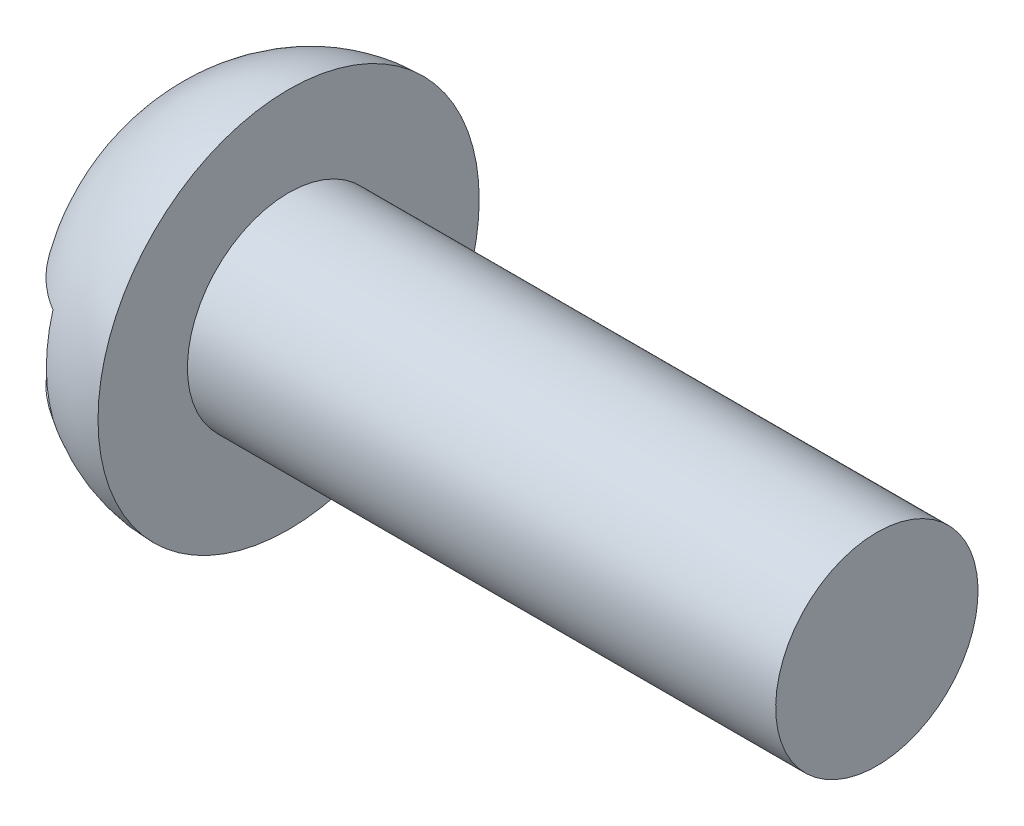
ISO-10303-21;
HEADER;
FILE_DESCRIPTION(('STEP AP214'),'2;1');
FILE_NAME('part.step','',(''),(''),'','','');
FILE_SCHEMA(('AUTOMOTIVE_DESIGN { 1 0 10303 214 1 1 1 1 }'));
ENDSEC;
DATA;
#1=APPLICATION_CONTEXT('core data for automotive mechanical design processes');
#2=APPLICATION_PROTOCOL_DEFINITION('international standard','automotive_design',2000,#1);
#3=PRODUCT_CONTEXT('',#1,'mechanical');
#4=PRODUCT('Part','Part','',(#3));
#5=PRODUCT_RELATED_PRODUCT_CATEGORY('part','',(#4));
#6=PRODUCT_DEFINITION_FORMATION('','',#4);
#7=PRODUCT_DEFINITION_CONTEXT('part definition',#1,'design');
#8=PRODUCT_DEFINITION('design','',#6,#7);
#9=PRODUCT_DEFINITION_SHAPE('','',#8);
#10=(LENGTH_UNIT() NAMED_UNIT(*) SI_UNIT(.MILLI.,.METRE.));
#11=(NAMED_UNIT(*) PLANE_ANGLE_UNIT() SI_UNIT($,.RADIAN.));
#12=(NAMED_UNIT(*) SI_UNIT($,.STERADIAN.) SOLID_ANGLE_UNIT());
#13=UNCERTAINTY_MEASURE_WITH_UNIT(LENGTH_MEASURE(1.E-05),#10,'distance_accuracy_value','');
#14=(GEOMETRIC_REPRESENTATION_CONTEXT(3) GLOBAL_UNCERTAINTY_ASSIGNED_CONTEXT((#13)) GLOBAL_UNIT_ASSIGNED_CONTEXT((#10,
#11,#12)) REPRESENTATION_CONTEXT('',''));
#15=CARTESIAN_POINT('',(0.,0.,0.));
#16=DIRECTION('',(0.,0.,1.));
#17=DIRECTION('',(1.,0.,0.));
#18=AXIS2_PLACEMENT_3D('',#15,#16,#17);
#19=CARTESIAN_POINT('',(0.,0.,0.));
#20=DIRECTION('',(0.,0.,1.));
#21=DIRECTION('',(0.,-1.,0.));
#22=AXIS2_PLACEMENT_3D('',#19,#20,#21);
#23=ELLIPSE('',#22,2.0574,1.7526);
#24=TRIMMED_CURVE('',#23,(PARAMETER_VALUE(1.5707963267949)),(PARAMETER_VALUE(4.71238898038469)),
.T.,.PARAMETER.);
#25=CARTESIAN_POINT('',(6.35,0.,0.));
#26=DIRECTION('',(1.,0.,0.));
#27=AXIS1_PLACEMENT('',#25,#26);
#28=SURFACE_OF_REVOLUTION('',#24,#27);
#29=CARTESIAN_POINT('',(0.,0.,0.));
#30=DIRECTION('',(1.,0.,0.));
#31=DIRECTION('',(0.,1.,0.));
#32=AXIS2_PLACEMENT_3D('',#29,#30,#31);
#33=CIRCLE('',#32,2.0574);
#34=CARTESIAN_POINT('',(0.,2.0574,0.));
#35=VERTEX_POINT('',#34);
#36=EDGE_CURVE('E84',#35,#35,#33,.T.);
#37=ORIENTED_EDGE('',*,*,#36,.F.);
#38=EDGE_LOOP('',(#37));
#39=FACE_BOUND('',#38,.T.);
#40=CARTESIAN_POINT('',(-0.762000000000001,0.,0.));
#41=DIRECTION('',(1.,0.,0.));
#42=DIRECTION('',(0.,1.,0.));
#43=AXIS2_PLACEMENT_3D('',#40,#41,#42);
#44=CIRCLE('',#43,1.85276161937338);
#45=CARTESIAN_POINT('',(-0.762000000000001,0.507999999999998,-1.78175801337423));
#46=VERTEX_POINT('',#45);
#47=CARTESIAN_POINT('',(-0.761999999999998,-0.508000000000002,-1.78175801337417));
#48=VERTEX_POINT('',#47);
#49=EDGE_CURVE('E54',#46,#48,#44,.F.);
#50=ORIENTED_EDGE('',*,*,#49,.F.);
#51=CARTESIAN_POINT('',(-0.761999999999953,0.508000000000018,-1.78175801337423));
#52=CARTESIAN_POINT('',(-0.805303767691,0.508000000000006,-1.75623799674382));
#53=CARTESIAN_POINT('',(-0.847381452258315,0.508,-1.72871332653575));
#54=CARTESIAN_POINT('',(-0.928864906417764,0.507999999999996,-1.67002702106103));
#55=CARTESIAN_POINT('',(-0.968273045108394,0.507999999999997,-1.63886867916826));
#56=CARTESIAN_POINT('',(-1.08178019710482,0.508,-1.54085566254209));
#57=CARTESIAN_POINT('',(-1.15173297109245,0.507999999999999,-1.46911977015333));
#58=CARTESIAN_POINT('',(-1.27914840741141,0.507999999999998,-1.31584748098206));
#59=CARTESIAN_POINT('',(-1.33665114619727,0.507999999999999,-1.23434388336978));
#60=CARTESIAN_POINT('',(-1.43919471643024,0.507999999999999,-1.06366357106317));
#61=CARTESIAN_POINT('',(-1.4842103617053,0.507999999999999,-0.974471817425083));
#62=CARTESIAN_POINT('',(-1.56674101884615,0.507999999999999,-0.778242233300024));
#63=CARTESIAN_POINT('',(-1.60240309425385,0.508,-0.670427105316586));
#64=CARTESIAN_POINT('',(-1.65726077616677,0.507999999999999,-0.450620084015112));
#65=CARTESIAN_POINT('',(-1.67644569093798,0.507999999999999,-0.338625527839086));
#66=CARTESIAN_POINT('',(-1.69344244151719,0.507999999999999,-0.163686370209726));
#67=CARTESIAN_POINT('',(-1.69697887165472,0.508,-0.101244458910566));
#68=CARTESIAN_POINT('',(-1.69904835789595,0.508,0.0236604160667283));
#69=CARTESIAN_POINT('',(-1.69758606336285,0.507999999999999,0.086123306179798));
#70=CARTESIAN_POINT('',(-1.68558771004064,0.507999999999998,0.274705969635401));
#71=CARTESIAN_POINT('',(-1.66728512706677,0.508,0.400425235435816));
#72=CARTESIAN_POINT('',(-1.61001688115887,0.508000000000002,0.647360702968799));
#73=CARTESIAN_POINT('',(-1.57100393867132,0.508000000000002,0.768565919311937));
#74=CARTESIAN_POINT('',(-1.47181036342349,0.508000000000002,1.00347950777996));
#75=CARTESIAN_POINT('',(-1.41142669345529,0.508000000000001,1.11710308917934));
#76=CARTESIAN_POINT('',(-1.27006865370249,0.508000000000002,1.33042875663453));
#77=CARTESIAN_POINT('',(-1.18917083522123,0.508000000000002,1.43018051004231));
#78=CARTESIAN_POINT('',(-1.04830764209436,0.508000000000002,1.57049191051726));
#79=CARTESIAN_POINT('',(-0.994897589925068,0.508000000000002,1.61772488120811));
#80=CARTESIAN_POINT('',(-0.882502185825077,0.508000000000002,1.70524515830728));
#81=CARTESIAN_POINT('',(-0.823505911688055,0.508000000000002,1.74551840408562));
#82=CARTESIAN_POINT('',(-0.761999999999999,0.508000000000002,1.78175801337417));
#83=B_SPLINE_CURVE_WITH_KNOTS('',3,(#51,#52,#53,#54,#55,#56,#57,#58,#59,#60,#61,#62,#63,#64,#65,
#66,#67,#68,#69,#70,#71,#72,#73,#74,#75,#76,#77,#78,#79,#80,#81,#82),.UNSPECIFIED.,.F.,.F.,(4,2,
2,2,2,2,2,2,2,2,2,2,2,2,2,4),(0.,0.150670541087812,0.301205568181994,0.600304504951253,
0.898425840909544,1.19714417931849,1.5364918567965,1.87605956489261,2.06350547786015,
2.25077709298813,2.63007112896101,3.01023480033271,3.39411179090208,3.77657684798849,
3.98997011199468,4.2037895753781),.UNSPECIFIED.);
#84=CARTESIAN_POINT('',(-0.761999999999999,0.508000000000002,1.78175801337417));
#85=VERTEX_POINT('',#84);
#86=EDGE_CURVE('E12',#46,#85,#83,.T.);
#87=ORIENTED_EDGE('',*,*,#86,.T.);
#88=CARTESIAN_POINT('',(-0.761999999999999,-0.507999999999998,1.78175801337423));
#89=VERTEX_POINT('',#88);
#90=EDGE_CURVE('E78',#89,#85,#44,.F.);
#91=ORIENTED_EDGE('',*,*,#90,.F.);
#92=CARTESIAN_POINT('',(-0.761999999999953,-0.508000000000018,1.78175801337423));
#93=CARTESIAN_POINT('',(-0.805296262348364,-0.508000000000005,1.75624249963892));
#94=CARTESIAN_POINT('',(-0.847366896486284,-0.508,1.72872288771288));
#95=CARTESIAN_POINT('',(-0.92883879768548,-0.507999999999996,1.67004674627668));
#96=CARTESIAN_POINT('',(-0.968242330116231,-0.507999999999997,1.63889336604553));
#97=CARTESIAN_POINT('',(-1.08175855452456,-0.508,1.54087798979724));
#98=CARTESIAN_POINT('',(-1.15172293513431,-0.507999999999999,1.46913255355151));
#99=CARTESIAN_POINT('',(-1.27916126595052,-0.507999999999998,1.31583130449832));
#100=CARTESIAN_POINT('',(-1.33667475503227,-0.507999999999998,1.23430786347686));
#101=CARTESIAN_POINT('',(-1.43921193049278,-0.507999999999999,1.06363163595884));
#102=CARTESIAN_POINT('',(-1.48421542523745,-0.507999999999999,0.974466815912827));
#103=CARTESIAN_POINT('',(-1.56675278060105,-0.507999999999999,0.778206269631621));
#104=CARTESIAN_POINT('',(-1.60242920034432,-0.507999999999999,0.670324095156931));
#105=CARTESIAN_POINT('',(-1.64355119254327,-0.507999999999999,0.505551658128357));
#106=CARTESIAN_POINT('',(-1.65519435766627,-0.507999999999999,0.450122659554731));
#107=CARTESIAN_POINT('',(-1.67437923198873,-0.508,0.338506283979449));
#108=CARTESIAN_POINT('',(-1.68191715906403,-0.508,0.28231825635511));
#109=CARTESIAN_POINT('',(-1.69963330449118,-0.508000000000001,0.0999493539164226));
#110=CARTESIAN_POINT('',(-1.70160874519714,-0.508,-0.0271174144302554));
#111=CARTESIAN_POINT('',(-1.68497673745053,-0.508,-0.279917776094671));
#112=CARTESIAN_POINT('',(-1.6663679474374,-0.508000000000001,-0.405651281978884));
#113=CARTESIAN_POINT('',(-1.62252757172299,-0.508000000000001,-0.592715727906266));
#114=CARTESIAN_POINT('',(-1.60481077449871,-0.508000000000001,-0.655879337525681));
#115=CARTESIAN_POINT('',(-1.56386683233843,-0.508000000000001,-0.78035473301079));
#116=CARTESIAN_POINT('',(-1.54064440221625,-0.508000000000001,-0.841668053026223));
#117=CARTESIAN_POINT('',(-1.48869332569673,-0.508000000000001,-0.961915449134593));
#118=CARTESIAN_POINT('',(-1.4599652197567,-0.508,-1.0208497580731));
#119=CARTESIAN_POINT('',(-1.39704852163469,-0.508000000000002,-1.13571551458242));
#120=CARTESIAN_POINT('',(-1.362860506216,-0.508000000000004,-1.19164727849732));
#121=CARTESIAN_POINT('',(-1.26942445655087,-0.507999999999997,-1.32869530404972));
#122=CARTESIAN_POINT('',(-1.20652409170658,-0.507999999999982,-1.40736886051904));
#123=CARTESIAN_POINT('',(-1.0687867275177,-0.508000000000022,-1.5532039292408));
#124=CARTESIAN_POINT('',(-0.993986281326532,-0.508000000000077,-1.62039942835467));
#125=CARTESIAN_POINT('',(-0.889557997369398,-0.508000000000032,-1.6986768966282));
#126=CARTESIAN_POINT('',(-0.864690712882097,-0.508000000000014,-1.7162847863272));
#127=CARTESIAN_POINT('',(-0.814031339485992,-0.50799999999999,-1.75009201909297));
#128=CARTESIAN_POINT('',(-0.788239628390847,-0.507999999999986,-1.76629192853631));
#129=CARTESIAN_POINT('',(-0.761999999999998,-0.508000000000003,-1.78175801337417));
#130=B_SPLINE_CURVE_WITH_KNOTS('',3,(#92,#93,#94,#95,#96,#97,#98,#99,#100,#101,#102,#103,#104,
#105,#106,#107,#108,#109,#110,#111,#112,#113,#114,#115,#116,#117,#118,#119,#120,#121,#122,#123,
#124,#125,#126,#127,#128,#129),.UNSPECIFIED.,.F.,.F.,(4,2,2,2,2,2,2,2,2,2,2,2,2,2,2,2,2,2,4),
(0.,0.150644526244938,0.301159450095888,0.600304389185023,0.898484960781146,1.19714404972277,
1.53655981518397,1.70634722429345,1.87629079375157,2.25575804493841,2.63525002905331,
2.83183719146749,3.02825660839238,3.22465675393439,3.42103616624642,3.72195133047633,
4.02195942064128,4.11333424659972,4.20467214417661),.UNSPECIFIED.);
#131=EDGE_CURVE('E72',#89,#48,#130,.T.);
#132=ORIENTED_EDGE('',*,*,#131,.T.);
#133=EDGE_LOOP('',(#50,#87,#91,#132));
#134=FACE_BOUND('',#133,.T.);
#135=ADVANCED_FACE('F39',(#39,#134),#28,.F.);
#136=CARTESIAN_POINT('',(6.35,1.0922,0.));
#137=DIRECTION('',(1.,0.,0.));
#138=DIRECTION('',(0.,1.,0.));
#139=AXIS2_PLACEMENT_3D('',#136,#137,#138);
#140=PLANE('',#139);
#141=CARTESIAN_POINT('',(6.35,0.,0.));
#142=DIRECTION('',(1.,0.,0.));
#143=DIRECTION('',(0.,1.,0.));
#144=AXIS2_PLACEMENT_3D('',#141,#142,#143);
#145=CIRCLE('',#144,1.0922);
#146=CARTESIAN_POINT('',(6.35,1.0922,0.));
#147=VERTEX_POINT('',#146);
#148=EDGE_CURVE('E79',#147,#147,#145,.T.);
#149=ORIENTED_EDGE('',*,*,#148,.T.);
#150=EDGE_LOOP('',(#149));
#151=FACE_BOUND('',#150,.T.);
#152=ADVANCED_FACE('F109',(#151),#140,.T.);
#153=CARTESIAN_POINT('',(6.35,0.,0.));
#154=DIRECTION('',(1.,0.,0.));
#155=DIRECTION('',(0.,1.,0.));
#156=AXIS2_PLACEMENT_3D('',#153,#154,#155);
#157=CYLINDRICAL_SURFACE('',#156,1.0922);
#158=CARTESIAN_POINT('',(0.,0.,0.));
#159=DIRECTION('',(1.,0.,0.));
#160=DIRECTION('',(0.,1.,0.));
#161=AXIS2_PLACEMENT_3D('',#158,#159,#160);
#162=CIRCLE('',#161,1.0922);
#163=CARTESIAN_POINT('',(0.,1.0922,0.));
#164=VERTEX_POINT('',#163);
#165=EDGE_CURVE('E121',#164,#164,#162,.T.);
#166=ORIENTED_EDGE('',*,*,#165,.T.);
#167=EDGE_LOOP('',(#166));
#168=FACE_BOUND('',#167,.T.);
#169=ORIENTED_EDGE('',*,*,#148,.F.);
#170=EDGE_LOOP('',(#169));
#171=FACE_BOUND('',#170,.T.);
#172=ADVANCED_FACE('F106',(#168,#171),#157,.T.);
#173=CARTESIAN_POINT('',(0.,2.0574,0.));
#174=DIRECTION('',(1.,0.,0.));
#175=DIRECTION('',(0.,1.,0.));
#176=AXIS2_PLACEMENT_3D('',#173,#174,#175);
#177=PLANE('',#176);
#178=ORIENTED_EDGE('',*,*,#36,.T.);
#179=EDGE_LOOP('',(#178));
#180=FACE_BOUND('',#179,.T.);
#181=ORIENTED_EDGE('',*,*,#165,.F.);
#182=EDGE_LOOP('',(#181));
#183=FACE_BOUND('',#182,.T.);
#184=ADVANCED_FACE('F100',(#180,#183),#177,.T.);
#185=CARTESIAN_POINT('',(-0.762,0.508,0.));
#186=DIRECTION('',(1.,0.,0.));
#187=DIRECTION('',(0.,0.,-1.));
#188=AXIS2_PLACEMENT_3D('',#185,#186,#187);
#189=PLANE('',#188);
#190=ORIENTED_EDGE('',*,*,#49,.T.);
#191=DIRECTION('',(0.,0.,-1.));
#192=VECTOR('',#191,1.);
#193=CARTESIAN_POINT('',(-0.762,-0.508,0.));
#194=LINE('',#193,#192);
#195=EDGE_CURVE('E60',#89,#48,#194,.T.);
#196=ORIENTED_EDGE('',*,*,#195,.F.);
#197=ORIENTED_EDGE('',*,*,#90,.T.);
#198=DIRECTION('',(0.,0.,-1.));
#199=VECTOR('',#198,1.);
#200=CARTESIAN_POINT('',(-0.762,0.508,0.));
#201=LINE('',#200,#199);
#202=EDGE_CURVE('E85',#85,#46,#201,.T.);
#203=ORIENTED_EDGE('',*,*,#202,.T.);
#204=EDGE_LOOP('',(#190,#196,#197,#203));
#205=FACE_BOUND('',#204,.T.);
#206=ADVANCED_FACE('F82',(#205),#189,.F.);
#207=CARTESIAN_POINT('',(-0.762,0.508,0.));
#208=DIRECTION('',(0.,-1.,0.));
#209=DIRECTION('',(0.,0.,-1.));
#210=AXIS2_PLACEMENT_3D('',#207,#208,#209);
#211=PLANE('',#210);
#212=ORIENTED_EDGE('',*,*,#202,.F.);
#213=ORIENTED_EDGE('',*,*,#86,.F.);
#214=EDGE_LOOP('',(#212,#213));
#215=FACE_BOUND('',#214,.T.);
#216=ADVANCED_FACE('F99',(#215),#211,.T.);
#217=CARTESIAN_POINT('',(-3.302,-0.508,0.));
#218=DIRECTION('',(0.,1.,0.));
#219=DIRECTION('',(0.,0.,1.));
#220=AXIS2_PLACEMENT_3D('',#217,#218,#219);
#221=PLANE('',#220);
#222=ORIENTED_EDGE('',*,*,#195,.T.);
#223=ORIENTED_EDGE('',*,*,#131,.F.);
#224=EDGE_LOOP('',(#222,#223));
#225=FACE_BOUND('',#224,.T.);
#226=ADVANCED_FACE('F73',(#225),#221,.T.);
#227=CLOSED_SHELL('',(#135,#152,#172,#184,#206,#216,#226));
#228=MANIFOLD_SOLID_BREP('B2',#227);
#229=ADVANCED_BREP_SHAPE_REPRESENTATION('',(#18,#228),#14);
#230=SHAPE_DEFINITION_REPRESENTATION(#9,#229);
ENDSEC;
END-ISO-10303-21;
